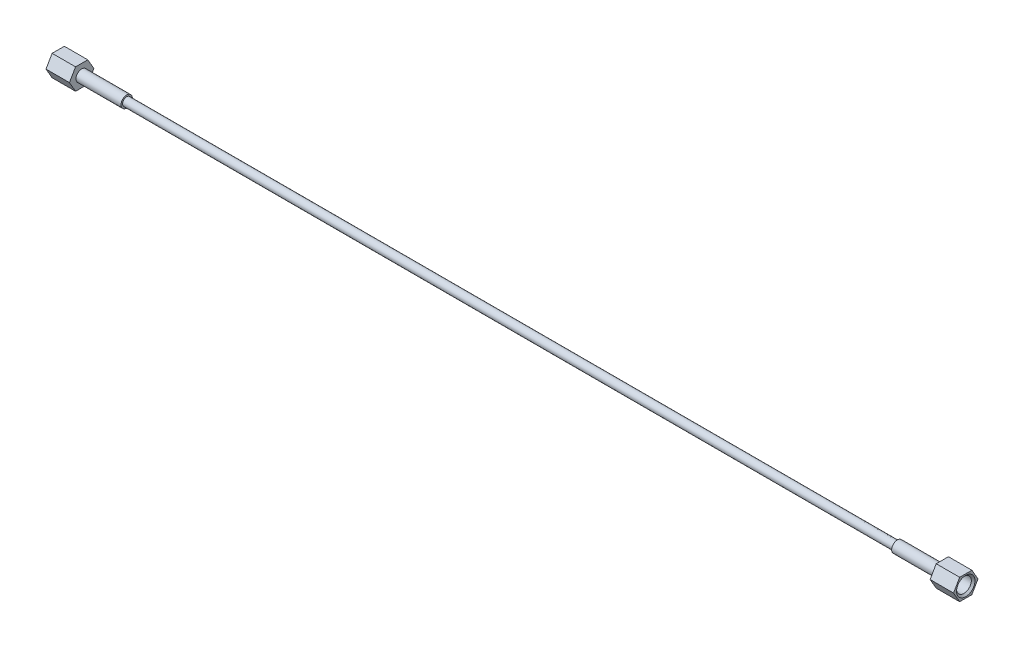
ISO-10303-21;
HEADER;
FILE_DESCRIPTION(('STEP AP214'),'2;1');
FILE_NAME('part.step','',(''),(''),'','','');
FILE_SCHEMA(('AUTOMOTIVE_DESIGN { 1 0 10303 214 1 1 1 1 }'));
ENDSEC;
DATA;
#1=APPLICATION_CONTEXT('core data for automotive mechanical design processes');
#2=APPLICATION_PROTOCOL_DEFINITION('international standard','automotive_design',2000,#1);
#3=PRODUCT_CONTEXT('',#1,'mechanical');
#4=PRODUCT('Part','Part','',(#3));
#5=PRODUCT_RELATED_PRODUCT_CATEGORY('part','',(#4));
#6=PRODUCT_DEFINITION_FORMATION('','',#4);
#7=PRODUCT_DEFINITION_CONTEXT('part definition',#1,'design');
#8=PRODUCT_DEFINITION('design','',#6,#7);
#9=PRODUCT_DEFINITION_SHAPE('','',#8);
#10=(LENGTH_UNIT() NAMED_UNIT(*) SI_UNIT(.MILLI.,.METRE.));
#11=(NAMED_UNIT(*) PLANE_ANGLE_UNIT() SI_UNIT($,.RADIAN.));
#12=(NAMED_UNIT(*) SI_UNIT($,.STERADIAN.) SOLID_ANGLE_UNIT());
#13=UNCERTAINTY_MEASURE_WITH_UNIT(LENGTH_MEASURE(1.E-05),#10,'distance_accuracy_value','');
#14=(GEOMETRIC_REPRESENTATION_CONTEXT(3) GLOBAL_UNCERTAINTY_ASSIGNED_CONTEXT((#13)) GLOBAL_UNIT_ASSIGNED_CONTEXT((#10,
#11,#12)) REPRESENTATION_CONTEXT('',''));
#15=CARTESIAN_POINT('',(0.,0.,0.));
#16=DIRECTION('',(0.,0.,1.));
#17=DIRECTION('',(1.,0.,0.));
#18=AXIS2_PLACEMENT_3D('',#15,#16,#17);
#19=CARTESIAN_POINT('',(-600.71,0.,-8.21223022895325));
#20=DIRECTION('',(0.,-0.500000000000001,0.866025403784438));
#21=DIRECTION('',(0.,-0.866025403784438,-0.500000000000001));
#22=AXIS2_PLACEMENT_3D('',#19,#20,#21);
#23=PLANE('',#22);
#24=DIRECTION('',(0.,0.866025403784438,0.500000000000001));
#25=VECTOR('',#24,1.);
#26=CARTESIAN_POINT('',(-584.962,0.,-8.21223022895325));
#27=LINE('',#26,#25);
#28=CARTESIAN_POINT('',(-584.962,0.,-8.21223022895325));
#29=VERTEX_POINT('',#28);
#30=CARTESIAN_POINT('',(-584.962,7.112,-4.10611511447662));
#31=VERTEX_POINT('',#30);
#32=EDGE_CURVE('E128',#29,#31,#27,.T.);
#33=ORIENTED_EDGE('',*,*,#32,.F.);
#34=DIRECTION('',(1.,0.,0.));
#35=VECTOR('',#34,1.);
#36=CARTESIAN_POINT('',(-600.71,0.,-8.21223022895325));
#37=LINE('',#36,#35);
#38=CARTESIAN_POINT('',(-600.71,0.,-8.21223022895325));
#39=VERTEX_POINT('',#38);
#40=EDGE_CURVE('E127',#39,#29,#37,.T.);
#41=ORIENTED_EDGE('',*,*,#40,.F.);
#42=DIRECTION('',(0.,0.866025403784438,0.500000000000001));
#43=VECTOR('',#42,1.);
#44=CARTESIAN_POINT('',(-600.71,0.,-8.21223022895325));
#45=LINE('',#44,#43);
#46=CARTESIAN_POINT('',(-600.71,7.112,-4.10611511447662));
#47=VERTEX_POINT('',#46);
#48=EDGE_CURVE('E141',#39,#47,#45,.T.);
#49=ORIENTED_EDGE('',*,*,#48,.T.);
#50=DIRECTION('',(1.,0.,0.));
#51=VECTOR('',#50,1.);
#52=CARTESIAN_POINT('',(-600.71,7.112,-4.10611511447662));
#53=LINE('',#52,#51);
#54=EDGE_CURVE('E148',#47,#31,#53,.T.);
#55=ORIENTED_EDGE('',*,*,#54,.T.);
#56=EDGE_LOOP('',(#33,#41,#49,#55));
#57=FACE_BOUND('',#56,.T.);
#58=ADVANCED_FACE('F44',(#57),#23,.F.);
#59=CARTESIAN_POINT('',(-600.71,7.112,-4.10611511447662));
#60=DIRECTION('',(0.,-1.,0.));
#61=DIRECTION('',(0.,0.,-1.));
#62=AXIS2_PLACEMENT_3D('',#59,#60,#61);
#63=PLANE('',#62);
#64=DIRECTION('',(0.,0.,1.));
#65=VECTOR('',#64,1.);
#66=CARTESIAN_POINT('',(-584.962,7.112,-4.10611511447662));
#67=LINE('',#66,#65);
#68=CARTESIAN_POINT('',(-584.962,7.112,4.10611511447661));
#69=VERTEX_POINT('',#68);
#70=EDGE_CURVE('E130',#31,#69,#67,.T.);
#71=ORIENTED_EDGE('',*,*,#70,.F.);
#72=ORIENTED_EDGE('',*,*,#54,.F.);
#73=DIRECTION('',(0.,0.,1.));
#74=VECTOR('',#73,1.);
#75=CARTESIAN_POINT('',(-600.71,7.112,-4.10611511447662));
#76=LINE('',#75,#74);
#77=CARTESIAN_POINT('',(-600.71,7.112,4.10611511447661));
#78=VERTEX_POINT('',#77);
#79=EDGE_CURVE('E93',#47,#78,#76,.T.);
#80=ORIENTED_EDGE('',*,*,#79,.T.);
#81=DIRECTION('',(1.,0.,0.));
#82=VECTOR('',#81,1.);
#83=CARTESIAN_POINT('',(-600.71,7.112,4.10611511447661));
#84=LINE('',#83,#82);
#85=EDGE_CURVE('E145',#78,#69,#84,.T.);
#86=ORIENTED_EDGE('',*,*,#85,.T.);
#87=EDGE_LOOP('',(#71,#72,#80,#86));
#88=FACE_BOUND('',#87,.T.);
#89=ADVANCED_FACE('F172',(#88),#63,.F.);
#90=CARTESIAN_POINT('',(-600.71,7.112,4.10611511447661));
#91=DIRECTION('',(0.,-0.500000000000001,-0.866025403784438));
#92=DIRECTION('',(0.,0.866025403784438,-0.500000000000001));
#93=AXIS2_PLACEMENT_3D('',#90,#91,#92);
#94=PLANE('',#93);
#95=DIRECTION('',(0.,-0.866025403784438,0.500000000000001));
#96=VECTOR('',#95,1.);
#97=CARTESIAN_POINT('',(-584.962,7.112,4.10611511447661));
#98=LINE('',#97,#96);
#99=CARTESIAN_POINT('',(-584.962,0.,8.21223022895324));
#100=VERTEX_POINT('',#99);
#101=EDGE_CURVE('E134',#69,#100,#98,.T.);
#102=ORIENTED_EDGE('',*,*,#101,.F.);
#103=ORIENTED_EDGE('',*,*,#85,.F.);
#104=DIRECTION('',(0.,-0.866025403784438,0.500000000000001));
#105=VECTOR('',#104,1.);
#106=CARTESIAN_POINT('',(-600.71,7.112,4.10611511447661));
#107=LINE('',#106,#105);
#108=CARTESIAN_POINT('',(-600.71,0.,8.21223022895324));
#109=VERTEX_POINT('',#108);
#110=EDGE_CURVE('E121',#78,#109,#107,.T.);
#111=ORIENTED_EDGE('',*,*,#110,.T.);
#112=DIRECTION('',(1.,0.,0.));
#113=VECTOR('',#112,1.);
#114=CARTESIAN_POINT('',(-600.71,0.,8.21223022895324));
#115=LINE('',#114,#113);
#116=EDGE_CURVE('E115',#109,#100,#115,.T.);
#117=ORIENTED_EDGE('',*,*,#116,.T.);
#118=EDGE_LOOP('',(#102,#103,#111,#117));
#119=FACE_BOUND('',#118,.T.);
#120=ADVANCED_FACE('F193',(#119),#94,.F.);
#121=CARTESIAN_POINT('',(-600.71,0.,8.21223022895324));
#122=DIRECTION('',(0.,0.500000000000001,-0.866025403784438));
#123=DIRECTION('',(0.,0.866025403784438,0.500000000000001));
#124=AXIS2_PLACEMENT_3D('',#121,#122,#123);
#125=PLANE('',#124);
#126=DIRECTION('',(0.,-0.866025403784438,-0.500000000000001));
#127=VECTOR('',#126,1.);
#128=CARTESIAN_POINT('',(-584.962,0.,8.21223022895324));
#129=LINE('',#128,#127);
#130=CARTESIAN_POINT('',(-584.962,-7.112,4.10611511447661));
#131=VERTEX_POINT('',#130);
#132=EDGE_CURVE('E137',#100,#131,#129,.T.);
#133=ORIENTED_EDGE('',*,*,#132,.F.);
#134=ORIENTED_EDGE('',*,*,#116,.F.);
#135=DIRECTION('',(0.,-0.866025403784438,-0.500000000000001));
#136=VECTOR('',#135,1.);
#137=CARTESIAN_POINT('',(-600.71,0.,8.21223022895324));
#138=LINE('',#137,#136);
#139=CARTESIAN_POINT('',(-600.71,-7.112,4.10611511447661));
#140=VERTEX_POINT('',#139);
#141=EDGE_CURVE('E105',#109,#140,#138,.T.);
#142=ORIENTED_EDGE('',*,*,#141,.T.);
#143=DIRECTION('',(1.,0.,0.));
#144=VECTOR('',#143,1.);
#145=CARTESIAN_POINT('',(-600.71,-7.112,4.10611511447661));
#146=LINE('',#145,#144);
#147=EDGE_CURVE('E110',#140,#131,#146,.T.);
#148=ORIENTED_EDGE('',*,*,#147,.T.);
#149=EDGE_LOOP('',(#133,#134,#142,#148));
#150=FACE_BOUND('',#149,.T.);
#151=ADVANCED_FACE('F118',(#150),#125,.F.);
#152=CARTESIAN_POINT('',(-600.71,-7.112,4.10611511447661));
#153=DIRECTION('',(0.,1.,0.));
#154=DIRECTION('',(0.,0.,1.));
#155=AXIS2_PLACEMENT_3D('',#152,#153,#154);
#156=PLANE('',#155);
#157=DIRECTION('',(0.,0.,-1.));
#158=VECTOR('',#157,1.);
#159=CARTESIAN_POINT('',(-584.962,-7.112,4.10611511447661));
#160=LINE('',#159,#158);
#161=CARTESIAN_POINT('',(-584.962,-7.112,-4.10611511447661));
#162=VERTEX_POINT('',#161);
#163=EDGE_CURVE('E112',#131,#162,#160,.T.);
#164=ORIENTED_EDGE('',*,*,#163,.F.);
#165=ORIENTED_EDGE('',*,*,#147,.F.);
#166=DIRECTION('',(0.,0.,-1.));
#167=VECTOR('',#166,1.);
#168=CARTESIAN_POINT('',(-600.71,-7.112,4.10611511447661));
#169=LINE('',#168,#167);
#170=CARTESIAN_POINT('',(-600.71,-7.112,-4.10611511447661));
#171=VERTEX_POINT('',#170);
#172=EDGE_CURVE('E101',#140,#171,#169,.T.);
#173=ORIENTED_EDGE('',*,*,#172,.T.);
#174=DIRECTION('',(1.,0.,0.));
#175=VECTOR('',#174,1.);
#176=CARTESIAN_POINT('',(-600.71,-7.112,-4.10611511447661));
#177=LINE('',#176,#175);
#178=EDGE_CURVE('E116',#171,#162,#177,.T.);
#179=ORIENTED_EDGE('',*,*,#178,.T.);
#180=EDGE_LOOP('',(#164,#165,#173,#179));
#181=FACE_BOUND('',#180,.T.);
#182=ADVANCED_FACE('F111',(#181),#156,.F.);
#183=CARTESIAN_POINT('',(-600.71,-7.112,-4.10611511447661));
#184=DIRECTION('',(0.,0.500000000000002,0.866025403784438));
#185=DIRECTION('',(0.,-0.866025403784438,0.500000000000001));
#186=AXIS2_PLACEMENT_3D('',#183,#184,#185);
#187=PLANE('',#186);
#188=DIRECTION('',(0.,0.866025403784438,-0.500000000000001));
#189=VECTOR('',#188,1.);
#190=CARTESIAN_POINT('',(-584.962,-7.112,-4.10611511447661));
#191=LINE('',#190,#189);
#192=EDGE_CURVE('E81',#162,#29,#191,.T.);
#193=ORIENTED_EDGE('',*,*,#192,.F.);
#194=ORIENTED_EDGE('',*,*,#178,.F.);
#195=DIRECTION('',(0.,0.866025403784438,-0.500000000000001));
#196=VECTOR('',#195,1.);
#197=CARTESIAN_POINT('',(-600.71,-7.112,-4.10611511447661));
#198=LINE('',#197,#196);
#199=EDGE_CURVE('E61',#171,#39,#198,.T.);
#200=ORIENTED_EDGE('',*,*,#199,.T.);
#201=ORIENTED_EDGE('',*,*,#40,.T.);
#202=EDGE_LOOP('',(#193,#194,#200,#201));
#203=FACE_BOUND('',#202,.T.);
#204=ADVANCED_FACE('F177',(#203),#187,.F.);
#205=CARTESIAN_POINT('',(-600.71,0.,-8.21223022895325));
#206=DIRECTION('',(1.,0.,0.));
#207=DIRECTION('',(0.,0.,1.));
#208=AXIS2_PLACEMENT_3D('',#205,#206,#207);
#209=PLANE('',#208);
#210=CARTESIAN_POINT('',(-600.71,0.,0.));
#211=DIRECTION('',(-1.,0.,0.));
#212=DIRECTION('',(0.,0.,1.));
#213=AXIS2_PLACEMENT_3D('',#210,#211,#212);
#214=CIRCLE('',#213,6.20077499999993);
#215=CARTESIAN_POINT('',(-600.71,0.,6.20077499999993));
#216=VERTEX_POINT('',#215);
#217=EDGE_CURVE('E12',#216,#216,#214,.T.);
#218=ORIENTED_EDGE('',*,*,#217,.F.);
#219=EDGE_LOOP('',(#218));
#220=FACE_BOUND('',#219,.T.);
#221=ORIENTED_EDGE('',*,*,#48,.F.);
#222=ORIENTED_EDGE('',*,*,#199,.F.);
#223=ORIENTED_EDGE('',*,*,#172,.F.);
#224=ORIENTED_EDGE('',*,*,#141,.F.);
#225=ORIENTED_EDGE('',*,*,#110,.F.);
#226=ORIENTED_EDGE('',*,*,#79,.F.);
#227=EDGE_LOOP('',(#221,#222,#223,#224,#225,#226));
#228=FACE_BOUND('',#227,.T.);
#229=ADVANCED_FACE('F103',(#220,#228),#209,.F.);
#230=CARTESIAN_POINT('',(-584.962,0.,-8.21223022895325));
#231=DIRECTION('',(1.,0.,0.));
#232=DIRECTION('',(0.,0.,1.));
#233=AXIS2_PLACEMENT_3D('',#230,#231,#232);
#234=PLANE('',#233);
#235=CARTESIAN_POINT('',(-584.962,0.,0.));
#236=DIRECTION('',(-1.,0.,0.));
#237=DIRECTION('',(0.,0.,1.));
#238=AXIS2_PLACEMENT_3D('',#235,#236,#237);
#239=CIRCLE('',#238,3.83540000000001);
#240=CARTESIAN_POINT('',(-584.962,0.,3.83540000000001));
#241=VERTEX_POINT('',#240);
#242=EDGE_CURVE('E131',#241,#241,#239,.T.);
#243=ORIENTED_EDGE('',*,*,#242,.T.);
#244=EDGE_LOOP('',(#243));
#245=FACE_BOUND('',#244,.T.);
#246=ORIENTED_EDGE('',*,*,#32,.T.);
#247=ORIENTED_EDGE('',*,*,#70,.T.);
#248=ORIENTED_EDGE('',*,*,#101,.T.);
#249=ORIENTED_EDGE('',*,*,#132,.T.);
#250=ORIENTED_EDGE('',*,*,#163,.T.);
#251=ORIENTED_EDGE('',*,*,#192,.T.);
#252=EDGE_LOOP('',(#246,#247,#248,#249,#250,#251));
#253=FACE_BOUND('',#252,.T.);
#254=ADVANCED_FACE('F184',(#245,#253),#234,.T.);
#255=CARTESIAN_POINT('',(-600.71,0.,0.));
#256=DIRECTION('',(-1.,0.,0.));
#257=DIRECTION('',(0.,0.,-1.));
#258=AXIS2_PLACEMENT_3D('',#255,#256,#257);
#259=CYLINDRICAL_SURFACE('',#258,3.83540000000001);
#260=CARTESIAN_POINT('',(-591.143899614258,0.,0.));
#261=DIRECTION('',(1.,0.,0.));
#262=DIRECTION('',(0.,0.,-1.));
#263=AXIS2_PLACEMENT_3D('',#260,#261,#262);
#264=CIRCLE('',#263,3.83540000000001);
#265=CARTESIAN_POINT('',(-591.143899614258,0.,-3.83540000000001));
#266=VERTEX_POINT('',#265);
#267=EDGE_CURVE('E163',#266,#266,#264,.T.);
#268=ORIENTED_EDGE('',*,*,#267,.F.);
#269=EDGE_LOOP('',(#268));
#270=FACE_BOUND('',#269,.T.);
#271=ORIENTED_EDGE('',*,*,#242,.F.);
#272=EDGE_LOOP('',(#271));
#273=FACE_BOUND('',#272,.T.);
#274=ADVANCED_FACE('F227',(#270,#273),#259,.F.);
#275=CARTESIAN_POINT('',(-591.82,0.,0.));
#276=DIRECTION('',(-1.,0.,0.));
#277=DIRECTION('',(0.,0.,-1.));
#278=AXIS2_PLACEMENT_3D('',#275,#276,#277);
#279=CONICAL_SURFACE('',#278,4.96062,1.02974425867667);
#280=ORIENTED_EDGE('',*,*,#267,.T.);
#281=EDGE_LOOP('',(#280));
#282=FACE_BOUND('',#281,.T.);
#283=CARTESIAN_POINT('',(-591.82,0.,0.));
#284=DIRECTION('',(1.,0.,0.));
#285=DIRECTION('',(0.,0.,-1.));
#286=AXIS2_PLACEMENT_3D('',#283,#284,#285);
#287=CIRCLE('',#286,4.96062);
#288=CARTESIAN_POINT('',(-591.82,0.,-4.96062));
#289=VERTEX_POINT('',#288);
#290=EDGE_CURVE('E161',#289,#289,#287,.T.);
#291=ORIENTED_EDGE('',*,*,#290,.F.);
#292=EDGE_LOOP('',(#291));
#293=FACE_BOUND('',#292,.T.);
#294=ADVANCED_FACE('F157',(#282,#293),#279,.F.);
#295=CARTESIAN_POINT('',(-600.71,0.,0.));
#296=DIRECTION('',(-1.,0.,0.));
#297=DIRECTION('',(0.,0.,-1.));
#298=AXIS2_PLACEMENT_3D('',#295,#296,#297);
#299=CYLINDRICAL_SURFACE('',#298,4.96062);
#300=CARTESIAN_POINT('',(-599.469845,0.,0.));
#301=DIRECTION('',(-1.,0.,0.));
#302=DIRECTION('',(0.,0.,1.));
#303=AXIS2_PLACEMENT_3D('',#300,#301,#302);
#304=CIRCLE('',#303,4.96062);
#305=CARTESIAN_POINT('',(-599.469845,0.,4.96062));
#306=VERTEX_POINT('',#305);
#307=EDGE_CURVE('E53',#306,#306,#304,.F.);
#308=ORIENTED_EDGE('',*,*,#307,.F.);
#309=EDGE_LOOP('',(#308));
#310=FACE_BOUND('',#309,.T.);
#311=ORIENTED_EDGE('',*,*,#290,.T.);
#312=EDGE_LOOP('',(#311));
#313=FACE_BOUND('',#312,.T.);
#314=ADVANCED_FACE('F154',(#310,#313),#299,.F.);
#315=CARTESIAN_POINT('',(-599.469845,0.,0.));
#316=DIRECTION('',(-1.,0.,0.));
#317=DIRECTION('',(0.,0.,-1.));
#318=AXIS2_PLACEMENT_3D('',#315,#316,#317);
#319=CONICAL_SURFACE('',#318,4.96062,0.785398163397451);
#320=ORIENTED_EDGE('',*,*,#217,.T.);
#321=EDGE_LOOP('',(#320));
#322=FACE_BOUND('',#321,.T.);
#323=ORIENTED_EDGE('',*,*,#307,.T.);
#324=EDGE_LOOP('',(#323));
#325=FACE_BOUND('',#324,.T.);
#326=ADVANCED_FACE('F46',(#322,#325),#319,.F.);
#327=CLOSED_SHELL('',(#58,#89,#120,#151,#182,#204,#229,#254,#274,#294,#314,#326));
#328=MANIFOLD_SOLID_BREP('B2',#327);
#329=CARTESIAN_POINT('',(-0.691362245465482,0.,0.));
#330=DIRECTION('',(-1.,0.,0.));
#331=DIRECTION('',(0.,0.,1.));
#332=AXIS2_PLACEMENT_3D('',#329,#330,#331);
#333=CYLINDRICAL_SURFACE('',#332,3.81);
#334=CARTESIAN_POINT('',(-0.691362245465465,0.,0.));
#335=DIRECTION('',(-1.,0.,0.));
#336=DIRECTION('',(0.,0.,1.));
#337=AXIS2_PLACEMENT_3D('',#334,#335,#336);
#338=CIRCLE('',#337,3.80999999999999);
#339=CARTESIAN_POINT('',(-0.691362245465465,0.,3.80999999999999));
#340=VERTEX_POINT('',#339);
#341=EDGE_CURVE('E323',#340,#340,#338,.T.);
#342=ORIENTED_EDGE('',*,*,#341,.T.);
#343=EDGE_LOOP('',(#342));
#344=FACE_BOUND('',#343,.T.);
#345=CARTESIAN_POINT('',(-37.084,0.,0.));
#346=DIRECTION('',(-1.,0.,0.));
#347=DIRECTION('',(0.,0.,1.));
#348=AXIS2_PLACEMENT_3D('',#345,#346,#347);
#349=CIRCLE('',#348,3.81);
#350=CARTESIAN_POINT('',(-37.084,0.,3.81));
#351=VERTEX_POINT('',#350);
#352=EDGE_CURVE('E43',#351,#351,#349,.T.);
#353=ORIENTED_EDGE('',*,*,#352,.F.);
#354=EDGE_LOOP('',(#353));
#355=FACE_BOUND('',#354,.T.);
#356=ADVANCED_FACE('F295',(#344,#355),#333,.T.);
#357=CARTESIAN_POINT('',(-37.084,2.76859999999997,0.));
#358=DIRECTION('',(-1.,0.,0.));
#359=DIRECTION('',(0.,0.,1.));
#360=AXIS2_PLACEMENT_3D('',#357,#358,#359);
#361=PLANE('',#360);
#362=ORIENTED_EDGE('',*,*,#352,.T.);
#363=EDGE_LOOP('',(#362));
#364=FACE_BOUND('',#363,.T.);
#365=CARTESIAN_POINT('',(-37.084,0.,0.));
#366=DIRECTION('',(-1.,0.,0.));
#367=DIRECTION('',(0.,0.,1.));
#368=AXIS2_PLACEMENT_3D('',#365,#366,#367);
#369=CIRCLE('',#368,2.76859999999997);
#370=CARTESIAN_POINT('',(-37.084,0.,2.76859999999997));
#371=VERTEX_POINT('',#370);
#372=EDGE_CURVE('E301',#371,#371,#369,.T.);
#373=ORIENTED_EDGE('',*,*,#372,.F.);
#374=EDGE_LOOP('',(#373));
#375=FACE_BOUND('',#374,.T.);
#376=ADVANCED_FACE('F341',(#364,#375),#361,.T.);
#377=CARTESIAN_POINT('',(-0.691362245465482,0.,0.));
#378=DIRECTION('',(-1.,0.,0.));
#379=DIRECTION('',(0.,0.,1.));
#380=AXIS2_PLACEMENT_3D('',#377,#378,#379);
#381=CYLINDRICAL_SURFACE('',#380,2.76860000000001);
#382=ORIENTED_EDGE('',*,*,#372,.T.);
#383=EDGE_LOOP('',(#382));
#384=FACE_BOUND('',#383,.T.);
#385=CARTESIAN_POINT('',(-554.736,0.,0.));
#386=DIRECTION('',(-1.,0.,0.));
#387=DIRECTION('',(0.,0.,1.));
#388=AXIS2_PLACEMENT_3D('',#385,#386,#387);
#389=CIRCLE('',#388,2.76860000000005);
#390=CARTESIAN_POINT('',(-554.736,0.,2.76860000000005));
#391=VERTEX_POINT('',#390);
#392=EDGE_CURVE('E305',#391,#391,#389,.T.);
#393=ORIENTED_EDGE('',*,*,#392,.F.);
#394=EDGE_LOOP('',(#393));
#395=FACE_BOUND('',#394,.T.);
#396=ADVANCED_FACE('F345',(#384,#395),#381,.T.);
#397=CARTESIAN_POINT('',(-554.736,2.76860000000005,0.));
#398=DIRECTION('',(1.,0.,0.));
#399=DIRECTION('',(0.,0.,-1.));
#400=AXIS2_PLACEMENT_3D('',#397,#398,#399);
#401=PLANE('',#400);
#402=ORIENTED_EDGE('',*,*,#392,.T.);
#403=EDGE_LOOP('',(#402));
#404=FACE_BOUND('',#403,.T.);
#405=CARTESIAN_POINT('',(-554.736,0.,0.));
#406=DIRECTION('',(-1.,0.,0.));
#407=DIRECTION('',(0.,0.,1.));
#408=AXIS2_PLACEMENT_3D('',#405,#406,#407);
#409=CIRCLE('',#408,3.81000000000006);
#410=CARTESIAN_POINT('',(-554.736,0.,3.81000000000006));
#411=VERTEX_POINT('',#410);
#412=EDGE_CURVE('E309',#411,#411,#409,.T.);
#413=ORIENTED_EDGE('',*,*,#412,.F.);
#414=EDGE_LOOP('',(#413));
#415=FACE_BOUND('',#414,.T.);
#416=ADVANCED_FACE('F349',(#404,#415),#401,.T.);
#417=CARTESIAN_POINT('',(-0.691362245465482,0.,0.));
#418=DIRECTION('',(-1.,0.,0.));
#419=DIRECTION('',(0.,0.,1.));
#420=AXIS2_PLACEMENT_3D('',#417,#418,#419);
#421=CYLINDRICAL_SURFACE('',#420,3.81000000000006);
#422=ORIENTED_EDGE('',*,*,#412,.T.);
#423=EDGE_LOOP('',(#422));
#424=FACE_BOUND('',#423,.T.);
#425=CARTESIAN_POINT('',(-591.128637754535,0.,0.));
#426=DIRECTION('',(-1.,0.,0.));
#427=DIRECTION('',(0.,0.,1.));
#428=AXIS2_PLACEMENT_3D('',#425,#426,#427);
#429=CIRCLE('',#428,3.81000000000007);
#430=CARTESIAN_POINT('',(-591.128637754535,0.,3.81000000000007));
#431=VERTEX_POINT('',#430);
#432=EDGE_CURVE('E314',#431,#431,#429,.T.);
#433=ORIENTED_EDGE('',*,*,#432,.F.);
#434=EDGE_LOOP('',(#433));
#435=FACE_BOUND('',#434,.T.);
#436=ADVANCED_FACE('F355',(#424,#435),#421,.T.);
#437=CARTESIAN_POINT('',(-589.434571325248,0.,0.));
#438=DIRECTION('',(-1.,0.,0.));
#439=DIRECTION('',(0.,0.,1.));
#440=AXIS2_PLACEMENT_3D('',#437,#438,#439);
#441=CONICAL_SURFACE('',#440,0.990600000000052,1.02974425867664);
#442=ORIENTED_EDGE('',*,*,#432,.T.);
#443=EDGE_LOOP('',(#442));
#444=FACE_BOUND('',#443,.T.);
#445=CARTESIAN_POINT('',(-589.434571325248,0.,0.));
#446=DIRECTION('',(-1.,0.,0.));
#447=DIRECTION('',(0.,0.,1.));
#448=AXIS2_PLACEMENT_3D('',#445,#446,#447);
#449=CIRCLE('',#448,0.990600000000052);
#450=CARTESIAN_POINT('',(-589.434571325248,0.,0.990600000000052));
#451=VERTEX_POINT('',#450);
#452=EDGE_CURVE('E317',#451,#451,#449,.T.);
#453=ORIENTED_EDGE('',*,*,#452,.F.);
#454=EDGE_LOOP('',(#453));
#455=FACE_BOUND('',#454,.T.);
#456=ADVANCED_FACE('F337',(#444,#455),#441,.F.);
#457=CARTESIAN_POINT('',(-0.691362245465482,0.,0.));
#458=DIRECTION('',(-1.,0.,0.));
#459=DIRECTION('',(0.,0.,1.));
#460=AXIS2_PLACEMENT_3D('',#457,#458,#459);
#461=CYLINDRICAL_SURFACE('',#460,0.990600000000016);
#462=ORIENTED_EDGE('',*,*,#452,.T.);
#463=EDGE_LOOP('',(#462));
#464=FACE_BOUND('',#463,.T.);
#465=CARTESIAN_POINT('',(-2.38542867475171,0.,0.));
#466=DIRECTION('',(-1.,0.,0.));
#467=DIRECTION('',(0.,0.,1.));
#468=AXIS2_PLACEMENT_3D('',#465,#466,#467);
#469=CIRCLE('',#468,0.99059999999998);
#470=CARTESIAN_POINT('',(-2.38542867475171,0.,0.99059999999998));
#471=VERTEX_POINT('',#470);
#472=EDGE_CURVE('E320',#471,#471,#469,.T.);
#473=ORIENTED_EDGE('',*,*,#472,.F.);
#474=EDGE_LOOP('',(#473));
#475=FACE_BOUND('',#474,.T.);
#476=ADVANCED_FACE('F331',(#464,#475),#461,.F.);
#477=CARTESIAN_POINT('',(-0.691362245465465,0.,0.));
#478=DIRECTION('',(1.,0.,0.));
#479=DIRECTION('',(0.,0.,-1.));
#480=AXIS2_PLACEMENT_3D('',#477,#478,#479);
#481=CONICAL_SURFACE('',#480,3.80999999999999,1.02974425867667);
#482=ORIENTED_EDGE('',*,*,#472,.T.);
#483=EDGE_LOOP('',(#482));
#484=FACE_BOUND('',#483,.T.);
#485=ORIENTED_EDGE('',*,*,#341,.F.);
#486=EDGE_LOOP('',(#485));
#487=FACE_BOUND('',#486,.T.);
#488=ADVANCED_FACE('F329',(#484,#487),#481,.F.);
#489=CLOSED_SHELL('',(#356,#376,#396,#416,#436,#456,#476,#488));
#490=MANIFOLD_SOLID_BREP('B6',#489);
#491=CARTESIAN_POINT('',(8.89,0.,-8.21223022895325));
#492=DIRECTION('',(0.,-0.500000000000001,0.866025403784438));
#493=DIRECTION('',(0.,-0.866025403784438,-0.500000000000001));
#494=AXIS2_PLACEMENT_3D('',#491,#492,#493);
#495=PLANE('',#494);
#496=DIRECTION('',(0.,0.866025403784438,0.500000000000001));
#497=VECTOR('',#496,1.);
#498=CARTESIAN_POINT('',(-6.858,0.,-8.21223022895325));
#499=LINE('',#498,#497);
#500=CARTESIAN_POINT('',(-6.858,0.,-8.21223022895325));
#501=VERTEX_POINT('',#500);
#502=CARTESIAN_POINT('',(-6.858,7.112,-4.10611511447662));
#503=VERTEX_POINT('',#502);
#504=EDGE_CURVE('E503',#501,#503,#499,.T.);
#505=ORIENTED_EDGE('',*,*,#504,.T.);
#506=DIRECTION('',(-1.,0.,0.));
#507=VECTOR('',#506,1.);
#508=CARTESIAN_POINT('',(8.89,7.112,-4.10611511447662));
#509=LINE('',#508,#507);
#510=CARTESIAN_POINT('',(8.89,7.112,-4.10611511447662));
#511=VERTEX_POINT('',#510);
#512=EDGE_CURVE('E521',#511,#503,#509,.T.);
#513=ORIENTED_EDGE('',*,*,#512,.F.);
#514=DIRECTION('',(0.,0.866025403784438,0.500000000000001));
#515=VECTOR('',#514,1.);
#516=CARTESIAN_POINT('',(8.89,0.,-8.21223022895325));
#517=LINE('',#516,#515);
#518=CARTESIAN_POINT('',(8.89,0.,-8.21223022895325));
#519=VERTEX_POINT('',#518);
#520=EDGE_CURVE('E514',#519,#511,#517,.T.);
#521=ORIENTED_EDGE('',*,*,#520,.F.);
#522=DIRECTION('',(-1.,0.,0.));
#523=VECTOR('',#522,1.);
#524=CARTESIAN_POINT('',(8.89,0.,-8.21223022895325));
#525=LINE('',#524,#523);
#526=EDGE_CURVE('E499',#519,#501,#525,.T.);
#527=ORIENTED_EDGE('',*,*,#526,.T.);
#528=EDGE_LOOP('',(#505,#513,#521,#527));
#529=FACE_BOUND('',#528,.T.);
#530=ADVANCED_FACE('F417',(#529),#495,.F.);
#531=CARTESIAN_POINT('',(8.89,7.112,-4.10611511447662));
#532=DIRECTION('',(0.,-1.,0.));
#533=DIRECTION('',(0.,0.,-1.));
#534=AXIS2_PLACEMENT_3D('',#531,#532,#533);
#535=PLANE('',#534);
#536=DIRECTION('',(0.,0.,1.));
#537=VECTOR('',#536,1.);
#538=CARTESIAN_POINT('',(-6.858,7.112,-4.10611511447662));
#539=LINE('',#538,#537);
#540=CARTESIAN_POINT('',(-6.858,7.112,4.10611511447661));
#541=VERTEX_POINT('',#540);
#542=EDGE_CURVE('E506',#503,#541,#539,.T.);
#543=ORIENTED_EDGE('',*,*,#542,.T.);
#544=DIRECTION('',(-1.,0.,0.));
#545=VECTOR('',#544,1.);
#546=CARTESIAN_POINT('',(8.89,7.112,4.10611511447661));
#547=LINE('',#546,#545);
#548=CARTESIAN_POINT('',(8.89,7.112,4.10611511447661));
#549=VERTEX_POINT('',#548);
#550=EDGE_CURVE('E518',#549,#541,#547,.T.);
#551=ORIENTED_EDGE('',*,*,#550,.F.);
#552=DIRECTION('',(0.,0.,1.));
#553=VECTOR('',#552,1.);
#554=CARTESIAN_POINT('',(8.89,7.112,-4.10611511447662));
#555=LINE('',#554,#553);
#556=EDGE_CURVE('E472',#511,#549,#555,.T.);
#557=ORIENTED_EDGE('',*,*,#556,.F.);
#558=ORIENTED_EDGE('',*,*,#512,.T.);
#559=EDGE_LOOP('',(#543,#551,#557,#558));
#560=FACE_BOUND('',#559,.T.);
#561=ADVANCED_FACE('F537',(#560),#535,.F.);
#562=CARTESIAN_POINT('',(8.89,7.112,4.10611511447661));
#563=DIRECTION('',(0.,-0.500000000000001,-0.866025403784438));
#564=DIRECTION('',(0.,0.866025403784438,-0.500000000000001));
#565=AXIS2_PLACEMENT_3D('',#562,#563,#564);
#566=PLANE('',#565);
#567=DIRECTION('',(0.,-0.866025403784438,0.500000000000001));
#568=VECTOR('',#567,1.);
#569=CARTESIAN_POINT('',(-6.858,7.112,4.10611511447661));
#570=LINE('',#569,#568);
#571=CARTESIAN_POINT('',(-6.858,0.,8.21223022895324));
#572=VERTEX_POINT('',#571);
#573=EDGE_CURVE('E509',#541,#572,#570,.T.);
#574=ORIENTED_EDGE('',*,*,#573,.T.);
#575=DIRECTION('',(-1.,0.,0.));
#576=VECTOR('',#575,1.);
#577=CARTESIAN_POINT('',(8.89,0.,8.21223022895324));
#578=LINE('',#577,#576);
#579=CARTESIAN_POINT('',(8.89,0.,8.21223022895324));
#580=VERTEX_POINT('',#579);
#581=EDGE_CURVE('E494',#580,#572,#578,.T.);
#582=ORIENTED_EDGE('',*,*,#581,.F.);
#583=DIRECTION('',(0.,-0.866025403784438,0.500000000000001));
#584=VECTOR('',#583,1.);
#585=CARTESIAN_POINT('',(8.89,7.112,4.10611511447661));
#586=LINE('',#585,#584);
#587=EDGE_CURVE('E485',#549,#580,#586,.T.);
#588=ORIENTED_EDGE('',*,*,#587,.F.);
#589=ORIENTED_EDGE('',*,*,#550,.T.);
#590=EDGE_LOOP('',(#574,#582,#588,#589));
#591=FACE_BOUND('',#590,.T.);
#592=ADVANCED_FACE('F542',(#591),#566,.F.);
#593=CARTESIAN_POINT('',(8.89,0.,8.21223022895324));
#594=DIRECTION('',(0.,0.500000000000001,-0.866025403784438));
#595=DIRECTION('',(0.,0.866025403784438,0.500000000000001));
#596=AXIS2_PLACEMENT_3D('',#593,#594,#595);
#597=PLANE('',#596);
#598=DIRECTION('',(0.,-0.866025403784438,-0.500000000000001));
#599=VECTOR('',#598,1.);
#600=CARTESIAN_POINT('',(-6.858,0.,8.21223022895324));
#601=LINE('',#600,#599);
#602=CARTESIAN_POINT('',(-6.858,-7.112,4.10611511447661));
#603=VERTEX_POINT('',#602);
#604=EDGE_CURVE('E493',#572,#603,#601,.T.);
#605=ORIENTED_EDGE('',*,*,#604,.T.);
#606=DIRECTION('',(-1.,0.,0.));
#607=VECTOR('',#606,1.);
#608=CARTESIAN_POINT('',(8.89,-7.112,4.10611511447661));
#609=LINE('',#608,#607);
#610=CARTESIAN_POINT('',(8.89,-7.112,4.10611511447661));
#611=VERTEX_POINT('',#610);
#612=EDGE_CURVE('E490',#611,#603,#609,.T.);
#613=ORIENTED_EDGE('',*,*,#612,.F.);
#614=DIRECTION('',(0.,-0.866025403784438,-0.500000000000001));
#615=VECTOR('',#614,1.);
#616=CARTESIAN_POINT('',(8.89,0.,8.21223022895324));
#617=LINE('',#616,#615);
#618=EDGE_CURVE('E479',#580,#611,#617,.T.);
#619=ORIENTED_EDGE('',*,*,#618,.F.);
#620=ORIENTED_EDGE('',*,*,#581,.T.);
#621=EDGE_LOOP('',(#605,#613,#619,#620));
#622=FACE_BOUND('',#621,.T.);
#623=ADVANCED_FACE('F491',(#622),#597,.F.);
#624=CARTESIAN_POINT('',(8.89,-7.112,4.10611511447661));
#625=DIRECTION('',(0.,1.,0.));
#626=DIRECTION('',(0.,0.,1.));
#627=AXIS2_PLACEMENT_3D('',#624,#625,#626);
#628=PLANE('',#627);
#629=DIRECTION('',(0.,0.,-1.));
#630=VECTOR('',#629,1.);
#631=CARTESIAN_POINT('',(-6.858,-7.112,4.10611511447661));
#632=LINE('',#631,#630);
#633=CARTESIAN_POINT('',(-6.858,-7.112,-4.10611511447661));
#634=VERTEX_POINT('',#633);
#635=EDGE_CURVE('E457',#603,#634,#632,.T.);
#636=ORIENTED_EDGE('',*,*,#635,.T.);
#637=DIRECTION('',(-1.,0.,0.));
#638=VECTOR('',#637,1.);
#639=CARTESIAN_POINT('',(8.89,-7.112,-4.10611511447661));
#640=LINE('',#639,#638);
#641=CARTESIAN_POINT('',(8.89,-7.112,-4.10611511447661));
#642=VERTEX_POINT('',#641);
#643=EDGE_CURVE('E495',#642,#634,#640,.T.);
#644=ORIENTED_EDGE('',*,*,#643,.F.);
#645=DIRECTION('',(0.,0.,-1.));
#646=VECTOR('',#645,1.);
#647=CARTESIAN_POINT('',(8.89,-7.112,4.10611511447661));
#648=LINE('',#647,#646);
#649=EDGE_CURVE('E483',#611,#642,#648,.T.);
#650=ORIENTED_EDGE('',*,*,#649,.F.);
#651=ORIENTED_EDGE('',*,*,#612,.T.);
#652=EDGE_LOOP('',(#636,#644,#650,#651));
#653=FACE_BOUND('',#652,.T.);
#654=ADVANCED_FACE('F497',(#653),#628,.F.);
#655=CARTESIAN_POINT('',(8.89,-7.112,-4.10611511447661));
#656=DIRECTION('',(0.,0.500000000000002,0.866025403784438));
#657=DIRECTION('',(0.,-0.866025403784438,0.500000000000001));
#658=AXIS2_PLACEMENT_3D('',#655,#656,#657);
#659=PLANE('',#658);
#660=DIRECTION('',(0.,0.866025403784438,-0.500000000000001));
#661=VECTOR('',#660,1.);
#662=CARTESIAN_POINT('',(-6.858,-7.112,-4.10611511447661));
#663=LINE('',#662,#661);
#664=EDGE_CURVE('E463',#634,#501,#663,.T.);
#665=ORIENTED_EDGE('',*,*,#664,.T.);
#666=ORIENTED_EDGE('',*,*,#526,.F.);
#667=DIRECTION('',(0.,0.866025403784438,-0.500000000000001));
#668=VECTOR('',#667,1.);
#669=CARTESIAN_POINT('',(8.89,-7.112,-4.10611511447661));
#670=LINE('',#669,#668);
#671=EDGE_CURVE('E434',#642,#519,#670,.T.);
#672=ORIENTED_EDGE('',*,*,#671,.F.);
#673=ORIENTED_EDGE('',*,*,#643,.T.);
#674=EDGE_LOOP('',(#665,#666,#672,#673));
#675=FACE_BOUND('',#674,.T.);
#676=ADVANCED_FACE('F552',(#675),#659,.F.);
#677=CARTESIAN_POINT('',(8.89,0.,-8.21223022895325));
#678=DIRECTION('',(-1.,0.,0.));
#679=DIRECTION('',(0.,0.,1.));
#680=AXIS2_PLACEMENT_3D('',#677,#678,#679);
#681=PLANE('',#680);
#682=CARTESIAN_POINT('',(8.89,0.,0.));
#683=DIRECTION('',(-1.,0.,0.));
#684=DIRECTION('',(0.,0.,1.));
#685=AXIS2_PLACEMENT_3D('',#682,#683,#684);
#686=CIRCLE('',#685,6.20077499999993);
#687=CARTESIAN_POINT('',(8.89,0.,6.20077499999993));
#688=VERTEX_POINT('',#687);
#689=EDGE_CURVE('E293',#688,#688,#686,.T.);
#690=ORIENTED_EDGE('',*,*,#689,.T.);
#691=EDGE_LOOP('',(#690));
#692=FACE_BOUND('',#691,.T.);
#693=ORIENTED_EDGE('',*,*,#520,.T.);
#694=ORIENTED_EDGE('',*,*,#556,.T.);
#695=ORIENTED_EDGE('',*,*,#587,.T.);
#696=ORIENTED_EDGE('',*,*,#618,.T.);
#697=ORIENTED_EDGE('',*,*,#649,.T.);
#698=ORIENTED_EDGE('',*,*,#671,.T.);
#699=EDGE_LOOP('',(#693,#694,#695,#696,#697,#698));
#700=FACE_BOUND('',#699,.T.);
#701=ADVANCED_FACE('F481',(#692,#700),#681,.F.);
#702=CARTESIAN_POINT('',(-6.858,0.,-8.21223022895325));
#703=DIRECTION('',(-1.,0.,0.));
#704=DIRECTION('',(0.,0.,1.));
#705=AXIS2_PLACEMENT_3D('',#702,#703,#704);
#706=PLANE('',#705);
#707=CARTESIAN_POINT('',(-6.858,0.,0.));
#708=DIRECTION('',(-1.,0.,0.));
#709=DIRECTION('',(0.,0.,1.));
#710=AXIS2_PLACEMENT_3D('',#707,#708,#709);
#711=CIRCLE('',#710,3.83540000000001);
#712=CARTESIAN_POINT('',(-6.858,0.,3.83540000000001));
#713=VERTEX_POINT('',#712);
#714=EDGE_CURVE('E507',#713,#713,#711,.T.);
#715=ORIENTED_EDGE('',*,*,#714,.F.);
#716=EDGE_LOOP('',(#715));
#717=FACE_BOUND('',#716,.T.);
#718=ORIENTED_EDGE('',*,*,#504,.F.);
#719=ORIENTED_EDGE('',*,*,#664,.F.);
#720=ORIENTED_EDGE('',*,*,#635,.F.);
#721=ORIENTED_EDGE('',*,*,#604,.F.);
#722=ORIENTED_EDGE('',*,*,#573,.F.);
#723=ORIENTED_EDGE('',*,*,#542,.F.);
#724=EDGE_LOOP('',(#718,#719,#720,#721,#722,#723));
#725=FACE_BOUND('',#724,.T.);
#726=ADVANCED_FACE('F555',(#717,#725),#706,.T.);
#727=CARTESIAN_POINT('',(8.89,0.,0.));
#728=DIRECTION('',(1.,0.,0.));
#729=DIRECTION('',(0.,0.,-1.));
#730=AXIS2_PLACEMENT_3D('',#727,#728,#729);
#731=CYLINDRICAL_SURFACE('',#730,3.83540000000001);
#732=CARTESIAN_POINT('',(-0.676100385742156,0.,0.));
#733=DIRECTION('',(1.,0.,0.));
#734=DIRECTION('',(0.,0.,-1.));
#735=AXIS2_PLACEMENT_3D('',#732,#733,#734);
#736=CIRCLE('',#735,3.83540000000001);
#737=CARTESIAN_POINT('',(-0.676100385742156,0.,-3.83540000000001));
#738=VERTEX_POINT('',#737);
#739=EDGE_CURVE('E573',#738,#738,#736,.T.);
#740=ORIENTED_EDGE('',*,*,#739,.T.);
#741=EDGE_LOOP('',(#740));
#742=FACE_BOUND('',#741,.T.);
#743=ORIENTED_EDGE('',*,*,#714,.T.);
#744=EDGE_LOOP('',(#743));
#745=FACE_BOUND('',#744,.T.);
#746=ADVANCED_FACE('F558',(#742,#745),#731,.F.);
#747=CARTESIAN_POINT('',(0.,0.,0.));
#748=DIRECTION('',(1.,0.,0.));
#749=DIRECTION('',(0.,0.,-1.));
#750=AXIS2_PLACEMENT_3D('',#747,#748,#749);
#751=CONICAL_SURFACE('',#750,4.96062,1.02974425867667);
#752=ORIENTED_EDGE('',*,*,#739,.F.);
#753=EDGE_LOOP('',(#752));
#754=FACE_BOUND('',#753,.T.);
#755=CARTESIAN_POINT('',(0.,0.,0.));
#756=DIRECTION('',(1.,0.,0.));
#757=DIRECTION('',(0.,0.,-1.));
#758=AXIS2_PLACEMENT_3D('',#755,#756,#757);
#759=CIRCLE('',#758,4.96062);
#760=CARTESIAN_POINT('',(0.,0.,-4.96062));
#761=VERTEX_POINT('',#760);
#762=EDGE_CURVE('E576',#761,#761,#759,.T.);
#763=ORIENTED_EDGE('',*,*,#762,.T.);
#764=EDGE_LOOP('',(#763));
#765=FACE_BOUND('',#764,.T.);
#766=ADVANCED_FACE('F533',(#754,#765),#751,.F.);
#767=CARTESIAN_POINT('',(8.89,0.,0.));
#768=DIRECTION('',(1.,0.,0.));
#769=DIRECTION('',(0.,0.,-1.));
#770=AXIS2_PLACEMENT_3D('',#767,#768,#769);
#771=CYLINDRICAL_SURFACE('',#770,4.96062);
#772=CARTESIAN_POINT('',(7.64984500000008,0.,0.));
#773=DIRECTION('',(-1.,0.,0.));
#774=DIRECTION('',(0.,0.,1.));
#775=AXIS2_PLACEMENT_3D('',#772,#773,#774);
#776=CIRCLE('',#775,4.96062);
#777=CARTESIAN_POINT('',(7.64984500000008,0.,4.96062));
#778=VERTEX_POINT('',#777);
#779=EDGE_CURVE('E426',#778,#778,#776,.F.);
#780=ORIENTED_EDGE('',*,*,#779,.T.);
#781=EDGE_LOOP('',(#780));
#782=FACE_BOUND('',#781,.T.);
#783=ORIENTED_EDGE('',*,*,#762,.F.);
#784=EDGE_LOOP('',(#783));
#785=FACE_BOUND('',#784,.T.);
#786=ADVANCED_FACE('F525',(#782,#785),#771,.F.);
#787=CARTESIAN_POINT('',(7.64984500000008,0.,0.));
#788=DIRECTION('',(1.,0.,0.));
#789=DIRECTION('',(0.,0.,-1.));
#790=AXIS2_PLACEMENT_3D('',#787,#788,#789);
#791=CONICAL_SURFACE('',#790,4.96062,0.785398163397451);
#792=ORIENTED_EDGE('',*,*,#689,.F.);
#793=EDGE_LOOP('',(#792));
#794=FACE_BOUND('',#793,.T.);
#795=ORIENTED_EDGE('',*,*,#779,.F.);
#796=EDGE_LOOP('',(#795));
#797=FACE_BOUND('',#796,.T.);
#798=ADVANCED_FACE('F419',(#794,#797),#791,.F.);
#799=CLOSED_SHELL('',(#530,#561,#592,#623,#654,#676,#701,#726,#746,#766,#786,#798));
#800=MANIFOLD_SOLID_BREP('B38',#799);
#801=ADVANCED_BREP_SHAPE_REPRESENTATION('',(#18,#328,#490,#800),#14);
#802=SHAPE_DEFINITION_REPRESENTATION(#9,#801);
ENDSEC;
END-ISO-10303-21;
